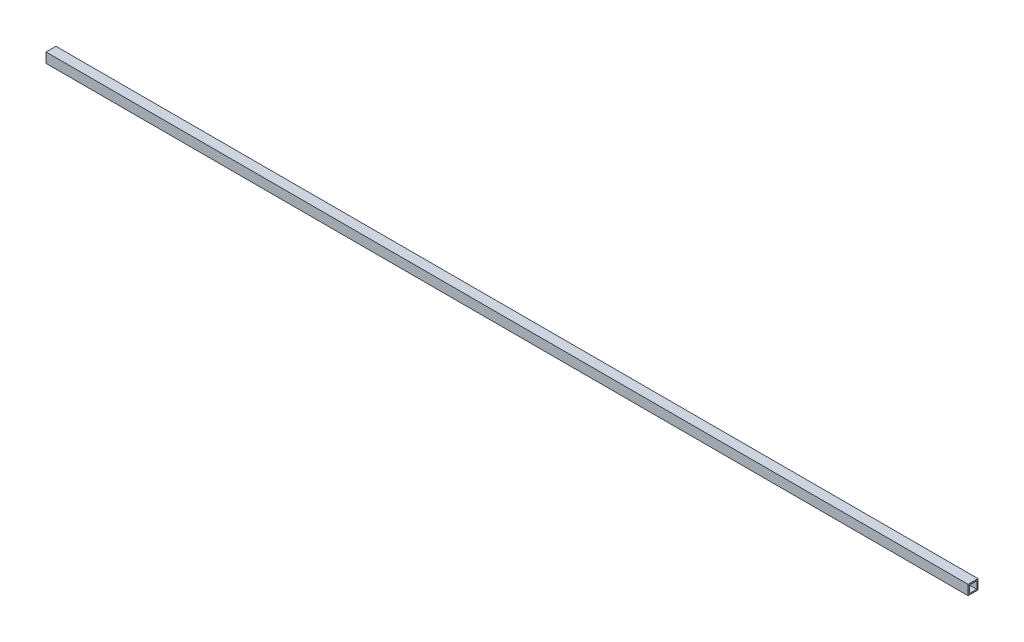
ISO-10303-21;
HEADER;
FILE_DESCRIPTION(('STEP AP214'),'2;1');
FILE_NAME('part.step','',(''),(''),'','','');
FILE_SCHEMA(('AUTOMOTIVE_DESIGN { 1 0 10303 214 1 1 1 1 }'));
ENDSEC;
DATA;
#1=APPLICATION_CONTEXT('core data for automotive mechanical design processes');
#2=APPLICATION_PROTOCOL_DEFINITION('international standard','automotive_design',2000,#1);
#3=PRODUCT_CONTEXT('',#1,'mechanical');
#4=PRODUCT('Part','Part','',(#3));
#5=PRODUCT_RELATED_PRODUCT_CATEGORY('part','',(#4));
#6=PRODUCT_DEFINITION_FORMATION('','',#4);
#7=PRODUCT_DEFINITION_CONTEXT('part definition',#1,'design');
#8=PRODUCT_DEFINITION('design','',#6,#7);
#9=PRODUCT_DEFINITION_SHAPE('','',#8);
#10=(LENGTH_UNIT() NAMED_UNIT(*) SI_UNIT(.MILLI.,.METRE.));
#11=(NAMED_UNIT(*) PLANE_ANGLE_UNIT() SI_UNIT($,.RADIAN.));
#12=(NAMED_UNIT(*) SI_UNIT($,.STERADIAN.) SOLID_ANGLE_UNIT());
#13=UNCERTAINTY_MEASURE_WITH_UNIT(LENGTH_MEASURE(1.E-05),#10,'distance_accuracy_value','');
#14=(GEOMETRIC_REPRESENTATION_CONTEXT(3) GLOBAL_UNCERTAINTY_ASSIGNED_CONTEXT((#13)) GLOBAL_UNIT_ASSIGNED_CONTEXT((#10,
#11,#12)) REPRESENTATION_CONTEXT('',''));
#15=CARTESIAN_POINT('',(0.,0.,0.));
#16=DIRECTION('',(0.,0.,1.));
#17=DIRECTION('',(1.,0.,0.));
#18=AXIS2_PLACEMENT_3D('',#15,#16,#17);
#19=CARTESIAN_POINT('',(4808.30704896854,25.4,-25.4));
#20=DIRECTION('',(0.,-1.,0.));
#21=DIRECTION('',(0.,0.,-1.));
#22=AXIS2_PLACEMENT_3D('',#19,#20,#21);
#23=PLANE('',#22);
#24=DIRECTION('',(0.,0.,1.));
#25=VECTOR('',#24,1.);
#26=CARTESIAN_POINT('',(4736.46499999999,25.4,-25.4));
#27=LINE('',#26,#25);
#28=CARTESIAN_POINT('',(4736.46499999999,25.4,-25.4));
#29=VERTEX_POINT('',#28);
#30=CARTESIAN_POINT('',(4736.46499999999,25.4,25.4));
#31=VERTEX_POINT('',#30);
#32=EDGE_CURVE('E159',#29,#31,#27,.T.);
#33=ORIENTED_EDGE('',*,*,#32,.F.);
#34=DIRECTION('',(-1.,0.,0.));
#35=VECTOR('',#34,1.);
#36=CARTESIAN_POINT('',(4808.30704896854,25.4,-25.4));
#37=LINE('',#36,#35);
#38=CARTESIAN_POINT('',(0.,25.4,-25.4));
#39=VERTEX_POINT('',#38);
#40=EDGE_CURVE('E50',#29,#39,#37,.T.);
#41=ORIENTED_EDGE('',*,*,#40,.T.);
#42=DIRECTION('',(0.,0.,1.));
#43=VECTOR('',#42,1.);
#44=CARTESIAN_POINT('',(0.,25.4,-25.4));
#45=LINE('',#44,#43);
#46=CARTESIAN_POINT('',(0.,25.4,25.4));
#47=VERTEX_POINT('',#46);
#48=EDGE_CURVE('E133',#39,#47,#45,.T.);
#49=ORIENTED_EDGE('',*,*,#48,.T.);
#50=DIRECTION('',(-1.,0.,0.));
#51=VECTOR('',#50,1.);
#52=CARTESIAN_POINT('',(4808.30704896854,25.4,25.4));
#53=LINE('',#52,#51);
#54=EDGE_CURVE('E136',#31,#47,#53,.T.);
#55=ORIENTED_EDGE('',*,*,#54,.F.);
#56=EDGE_LOOP('',(#33,#41,#49,#55));
#57=FACE_BOUND('',#56,.T.);
#58=ADVANCED_FACE('F35',(#57),#23,.F.);
#59=CARTESIAN_POINT('',(4808.30704896854,25.4,-25.4));
#60=DIRECTION('',(0.,0.,1.));
#61=DIRECTION('',(0.,-1.,0.));
#62=AXIS2_PLACEMENT_3D('',#59,#60,#61);
#63=PLANE('',#62);
#64=DIRECTION('',(0.,1.,0.));
#65=VECTOR('',#64,1.);
#66=CARTESIAN_POINT('',(4736.46499999999,25.4,-25.4));
#67=LINE('',#66,#65);
#68=CARTESIAN_POINT('',(4736.46499999999,-25.4,-25.4));
#69=VERTEX_POINT('',#68);
#70=EDGE_CURVE('E162',#69,#29,#67,.T.);
#71=ORIENTED_EDGE('',*,*,#70,.F.);
#72=DIRECTION('',(-1.,0.,0.));
#73=VECTOR('',#72,1.);
#74=CARTESIAN_POINT('',(4808.30704896854,-25.4,-25.4));
#75=LINE('',#74,#73);
#76=CARTESIAN_POINT('',(0.,-25.4,-25.4));
#77=VERTEX_POINT('',#76);
#78=EDGE_CURVE('E139',#69,#77,#75,.T.);
#79=ORIENTED_EDGE('',*,*,#78,.T.);
#80=DIRECTION('',(0.,1.,0.));
#81=VECTOR('',#80,1.);
#82=CARTESIAN_POINT('',(0.,25.4,-25.4));
#83=LINE('',#82,#81);
#84=EDGE_CURVE('E131',#77,#39,#83,.T.);
#85=ORIENTED_EDGE('',*,*,#84,.T.);
#86=ORIENTED_EDGE('',*,*,#40,.F.);
#87=EDGE_LOOP('',(#71,#79,#85,#86));
#88=FACE_BOUND('',#87,.T.);
#89=ADVANCED_FACE('F161',(#88),#63,.F.);
#90=CARTESIAN_POINT('',(4808.30704896854,-25.4,-25.4));
#91=DIRECTION('',(0.,1.,0.));
#92=DIRECTION('',(0.,0.,1.));
#93=AXIS2_PLACEMENT_3D('',#90,#91,#92);
#94=PLANE('',#93);
#95=DIRECTION('',(0.,0.,-1.));
#96=VECTOR('',#95,1.);
#97=CARTESIAN_POINT('',(4736.46499999999,-25.4,-25.4));
#98=LINE('',#97,#96);
#99=CARTESIAN_POINT('',(4736.46499999999,-25.4,25.4));
#100=VERTEX_POINT('',#99);
#101=EDGE_CURVE('E147',#100,#69,#98,.T.);
#102=ORIENTED_EDGE('',*,*,#101,.F.);
#103=DIRECTION('',(-1.,0.,0.));
#104=VECTOR('',#103,1.);
#105=CARTESIAN_POINT('',(4808.30704896854,-25.4,25.4));
#106=LINE('',#105,#104);
#107=CARTESIAN_POINT('',(0.,-25.4,25.4));
#108=VERTEX_POINT('',#107);
#109=EDGE_CURVE('E43',#100,#108,#106,.T.);
#110=ORIENTED_EDGE('',*,*,#109,.T.);
#111=DIRECTION('',(0.,0.,-1.));
#112=VECTOR('',#111,1.);
#113=CARTESIAN_POINT('',(0.,-25.4,-25.4));
#114=LINE('',#113,#112);
#115=EDGE_CURVE('E128',#108,#77,#114,.T.);
#116=ORIENTED_EDGE('',*,*,#115,.T.);
#117=ORIENTED_EDGE('',*,*,#78,.F.);
#118=EDGE_LOOP('',(#102,#110,#116,#117));
#119=FACE_BOUND('',#118,.T.);
#120=ADVANCED_FACE('F143',(#119),#94,.F.);
#121=CARTESIAN_POINT('',(4808.30704896854,25.4,25.4));
#122=DIRECTION('',(0.,0.,-1.));
#123=DIRECTION('',(-1.,0.,0.));
#124=AXIS2_PLACEMENT_3D('',#121,#122,#123);
#125=PLANE('',#124);
#126=DIRECTION('',(0.,-1.,0.));
#127=VECTOR('',#126,1.);
#128=CARTESIAN_POINT('',(4736.46499999999,25.4,25.4));
#129=LINE('',#128,#127);
#130=EDGE_CURVE('E156',#31,#100,#129,.T.);
#131=ORIENTED_EDGE('',*,*,#130,.F.);
#132=ORIENTED_EDGE('',*,*,#54,.T.);
#133=DIRECTION('',(0.,-1.,0.));
#134=VECTOR('',#133,1.);
#135=CARTESIAN_POINT('',(0.,25.4,25.4));
#136=LINE('',#135,#134);
#137=EDGE_CURVE('E125',#47,#108,#136,.T.);
#138=ORIENTED_EDGE('',*,*,#137,.T.);
#139=ORIENTED_EDGE('',*,*,#109,.F.);
#140=EDGE_LOOP('',(#131,#132,#138,#139));
#141=FACE_BOUND('',#140,.T.);
#142=ADVANCED_FACE('F37',(#141),#125,.F.);
#143=CARTESIAN_POINT('',(0.,0.,0.));
#144=DIRECTION('',(-1.,0.,0.));
#145=DIRECTION('',(0.,0.,1.));
#146=AXIS2_PLACEMENT_3D('',#143,#144,#145);
#147=PLANE('',#146);
#148=ORIENTED_EDGE('',*,*,#137,.F.);
#149=ORIENTED_EDGE('',*,*,#48,.F.);
#150=ORIENTED_EDGE('',*,*,#84,.F.);
#151=ORIENTED_EDGE('',*,*,#115,.F.);
#152=EDGE_LOOP('',(#148,#149,#150,#151));
#153=FACE_BOUND('',#152,.T.);
#154=DIRECTION('',(0.,1.,0.));
#155=VECTOR('',#154,1.);
#156=CARTESIAN_POINT('',(0.,19.05,-19.05));
#157=LINE('',#156,#155);
#158=CARTESIAN_POINT('',(0.,-19.05,-19.05));
#159=VERTEX_POINT('',#158);
#160=CARTESIAN_POINT('',(0.,19.05,-19.05));
#161=VERTEX_POINT('',#160);
#162=EDGE_CURVE('E115',#159,#161,#157,.T.);
#163=ORIENTED_EDGE('',*,*,#162,.T.);
#164=DIRECTION('',(0.,0.,1.));
#165=VECTOR('',#164,1.);
#166=CARTESIAN_POINT('',(0.,19.05,-19.05));
#167=LINE('',#166,#165);
#168=CARTESIAN_POINT('',(0.,19.05,19.05));
#169=VERTEX_POINT('',#168);
#170=EDGE_CURVE('E164',#161,#169,#167,.T.);
#171=ORIENTED_EDGE('',*,*,#170,.T.);
#172=DIRECTION('',(0.,-1.,0.));
#173=VECTOR('',#172,1.);
#174=CARTESIAN_POINT('',(0.,19.05,19.05));
#175=LINE('',#174,#173);
#176=CARTESIAN_POINT('',(0.,-19.05,19.05));
#177=VERTEX_POINT('',#176);
#178=EDGE_CURVE('E171',#169,#177,#175,.T.);
#179=ORIENTED_EDGE('',*,*,#178,.T.);
#180=DIRECTION('',(0.,0.,-1.));
#181=VECTOR('',#180,1.);
#182=CARTESIAN_POINT('',(0.,-19.05,-19.05));
#183=LINE('',#182,#181);
#184=EDGE_CURVE('E174',#177,#159,#183,.T.);
#185=ORIENTED_EDGE('',*,*,#184,.T.);
#186=EDGE_LOOP('',(#163,#171,#179,#185));
#187=FACE_BOUND('',#186,.T.);
#188=ADVANCED_FACE('F153',(#153,#187),#147,.T.);
#189=CARTESIAN_POINT('',(4808.30704896854,19.05,-19.05));
#190=DIRECTION('',(0.,0.,1.));
#191=DIRECTION('',(0.,-1.,0.));
#192=AXIS2_PLACEMENT_3D('',#189,#190,#191);
#193=PLANE('',#192);
#194=DIRECTION('',(-1.,0.,0.));
#195=VECTOR('',#194,1.);
#196=CARTESIAN_POINT('',(4808.30704896854,-19.05,-19.05));
#197=LINE('',#196,#195);
#198=CARTESIAN_POINT('',(4736.46499999999,-19.05,-19.05));
#199=VERTEX_POINT('',#198);
#200=EDGE_CURVE('E107',#199,#159,#197,.T.);
#201=ORIENTED_EDGE('',*,*,#200,.F.);
#202=DIRECTION('',(0.,1.,0.));
#203=VECTOR('',#202,1.);
#204=CARTESIAN_POINT('',(4736.46499999999,19.05,-19.05));
#205=LINE('',#204,#203);
#206=CARTESIAN_POINT('',(4736.46499999999,19.05,-19.05));
#207=VERTEX_POINT('',#206);
#208=EDGE_CURVE('E11',#199,#207,#205,.T.);
#209=ORIENTED_EDGE('',*,*,#208,.T.);
#210=DIRECTION('',(-1.,0.,0.));
#211=VECTOR('',#210,1.);
#212=CARTESIAN_POINT('',(4808.30704896854,19.05,-19.05));
#213=LINE('',#212,#211);
#214=EDGE_CURVE('E117',#207,#161,#213,.T.);
#215=ORIENTED_EDGE('',*,*,#214,.T.);
#216=ORIENTED_EDGE('',*,*,#162,.F.);
#217=EDGE_LOOP('',(#201,#209,#215,#216));
#218=FACE_BOUND('',#217,.T.);
#219=ADVANCED_FACE('F113',(#218),#193,.T.);
#220=CARTESIAN_POINT('',(4808.30704896854,-19.05,-19.05));
#221=DIRECTION('',(0.,1.,0.));
#222=DIRECTION('',(0.,0.,1.));
#223=AXIS2_PLACEMENT_3D('',#220,#221,#222);
#224=PLANE('',#223);
#225=DIRECTION('',(-1.,0.,0.));
#226=VECTOR('',#225,1.);
#227=CARTESIAN_POINT('',(4808.30704896854,-19.05,19.05));
#228=LINE('',#227,#226);
#229=CARTESIAN_POINT('',(4736.46499999999,-19.05,19.05));
#230=VERTEX_POINT('',#229);
#231=EDGE_CURVE('E109',#230,#177,#228,.T.);
#232=ORIENTED_EDGE('',*,*,#231,.F.);
#233=DIRECTION('',(0.,0.,-1.));
#234=VECTOR('',#233,1.);
#235=CARTESIAN_POINT('',(4736.46499999999,-19.05,-19.05));
#236=LINE('',#235,#234);
#237=EDGE_CURVE('E100',#230,#199,#236,.T.);
#238=ORIENTED_EDGE('',*,*,#237,.T.);
#239=ORIENTED_EDGE('',*,*,#200,.T.);
#240=ORIENTED_EDGE('',*,*,#184,.F.);
#241=EDGE_LOOP('',(#232,#238,#239,#240));
#242=FACE_BOUND('',#241,.T.);
#243=ADVANCED_FACE('F105',(#242),#224,.T.);
#244=CARTESIAN_POINT('',(4808.30704896854,19.05,19.05));
#245=DIRECTION('',(0.,0.,-1.));
#246=DIRECTION('',(0.,1.,0.));
#247=AXIS2_PLACEMENT_3D('',#244,#245,#246);
#248=PLANE('',#247);
#249=DIRECTION('',(-1.,0.,0.));
#250=VECTOR('',#249,1.);
#251=CARTESIAN_POINT('',(4808.30704896854,19.05,19.05));
#252=LINE('',#251,#250);
#253=CARTESIAN_POINT('',(4736.46499999999,19.05,19.05));
#254=VERTEX_POINT('',#253);
#255=EDGE_CURVE('E119',#254,#169,#252,.T.);
#256=ORIENTED_EDGE('',*,*,#255,.F.);
#257=DIRECTION('',(0.,-1.,0.));
#258=VECTOR('',#257,1.);
#259=CARTESIAN_POINT('',(4736.46499999999,19.05,19.05));
#260=LINE('',#259,#258);
#261=EDGE_CURVE('E111',#254,#230,#260,.T.);
#262=ORIENTED_EDGE('',*,*,#261,.T.);
#263=ORIENTED_EDGE('',*,*,#231,.T.);
#264=ORIENTED_EDGE('',*,*,#178,.F.);
#265=EDGE_LOOP('',(#256,#262,#263,#264));
#266=FACE_BOUND('',#265,.T.);
#267=ADVANCED_FACE('F179',(#266),#248,.T.);
#268=CARTESIAN_POINT('',(4808.30704896854,19.05,-19.05));
#269=DIRECTION('',(0.,-1.,0.));
#270=DIRECTION('',(0.,0.,-1.));
#271=AXIS2_PLACEMENT_3D('',#268,#269,#270);
#272=PLANE('',#271);
#273=ORIENTED_EDGE('',*,*,#214,.F.);
#274=DIRECTION('',(0.,0.,1.));
#275=VECTOR('',#274,1.);
#276=CARTESIAN_POINT('',(4736.46499999999,19.05,-19.05));
#277=LINE('',#276,#275);
#278=EDGE_CURVE('E58',#207,#254,#277,.T.);
#279=ORIENTED_EDGE('',*,*,#278,.T.);
#280=ORIENTED_EDGE('',*,*,#255,.T.);
#281=ORIENTED_EDGE('',*,*,#170,.F.);
#282=EDGE_LOOP('',(#273,#279,#280,#281));
#283=FACE_BOUND('',#282,.T.);
#284=ADVANCED_FACE('F183',(#283),#272,.T.);
#285=CARTESIAN_POINT('',(4736.46499999999,-31.75,-652.045130055595));
#286=DIRECTION('',(1.,0.,0.));
#287=DIRECTION('',(0.,0.,-1.));
#288=AXIS2_PLACEMENT_3D('',#285,#286,#287);
#289=PLANE('',#288);
#290=ORIENTED_EDGE('',*,*,#278,.F.);
#291=ORIENTED_EDGE('',*,*,#208,.F.);
#292=ORIENTED_EDGE('',*,*,#237,.F.);
#293=ORIENTED_EDGE('',*,*,#261,.F.);
#294=EDGE_LOOP('',(#290,#291,#292,#293));
#295=FACE_BOUND('',#294,.T.);
#296=ORIENTED_EDGE('',*,*,#32,.T.);
#297=ORIENTED_EDGE('',*,*,#130,.T.);
#298=ORIENTED_EDGE('',*,*,#101,.T.);
#299=ORIENTED_EDGE('',*,*,#70,.T.);
#300=EDGE_LOOP('',(#296,#297,#298,#299));
#301=FACE_BOUND('',#300,.T.);
#302=ADVANCED_FACE('F98',(#295,#301),#289,.T.);
#303=CLOSED_SHELL('',(#58,#89,#120,#142,#188,#219,#243,#267,#284,#302));
#304=MANIFOLD_SOLID_BREP('B2',#303);
#305=ADVANCED_BREP_SHAPE_REPRESENTATION('',(#18,#304),#14);
#306=SHAPE_DEFINITION_REPRESENTATION(#9,#305);
ENDSEC;
END-ISO-10303-21;
